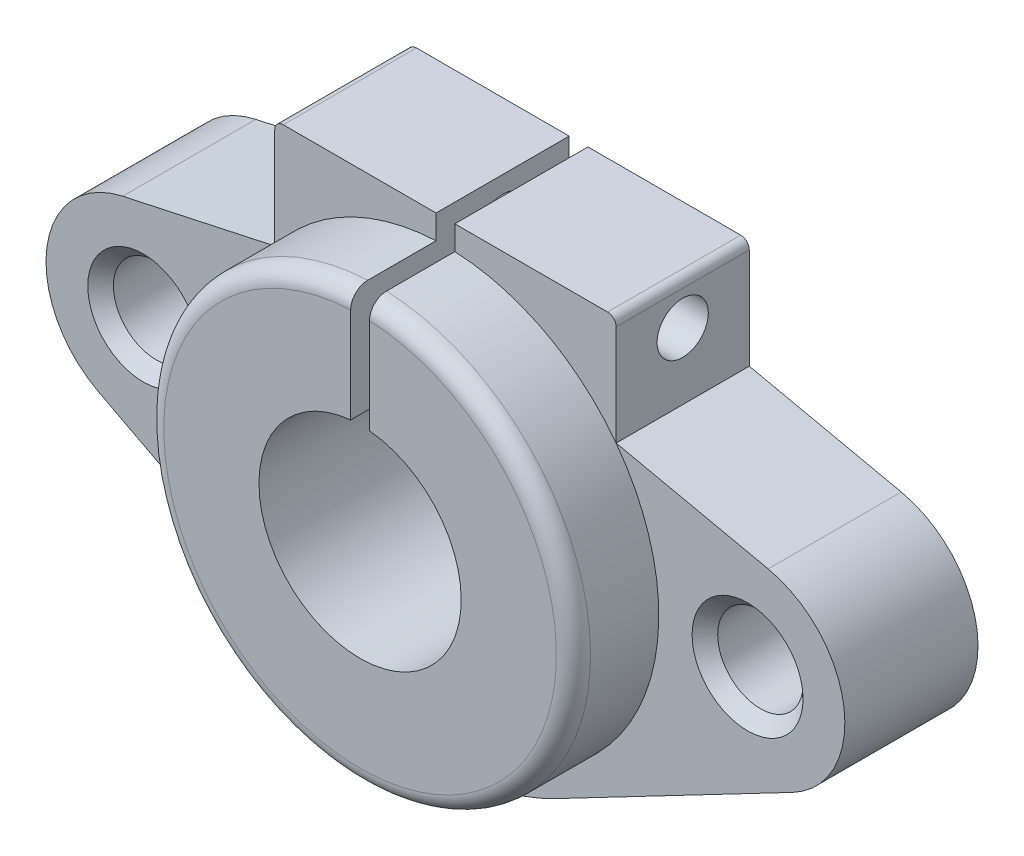
ISO-10303-21;
HEADER;
FILE_DESCRIPTION(('STEP AP214'),'2;1');
FILE_NAME('part.step','',(''),(''),'','','');
FILE_SCHEMA(('AUTOMOTIVE_DESIGN { 1 0 10303 214 1 1 1 1 }'));
ENDSEC;
DATA;
#1=APPLICATION_CONTEXT('core data for automotive mechanical design processes');
#2=APPLICATION_PROTOCOL_DEFINITION('international standard','automotive_design',2000,#1);
#3=PRODUCT_CONTEXT('',#1,'mechanical');
#4=PRODUCT('Part','Part','',(#3));
#5=PRODUCT_RELATED_PRODUCT_CATEGORY('part','',(#4));
#6=PRODUCT_DEFINITION_FORMATION('','',#4);
#7=PRODUCT_DEFINITION_CONTEXT('part definition',#1,'design');
#8=PRODUCT_DEFINITION('design','',#6,#7);
#9=PRODUCT_DEFINITION_SHAPE('','',#8);
#10=(LENGTH_UNIT() NAMED_UNIT(*) SI_UNIT(.MILLI.,.METRE.));
#11=(NAMED_UNIT(*) PLANE_ANGLE_UNIT() SI_UNIT($,.RADIAN.));
#12=(NAMED_UNIT(*) SI_UNIT($,.STERADIAN.) SOLID_ANGLE_UNIT());
#13=UNCERTAINTY_MEASURE_WITH_UNIT(LENGTH_MEASURE(1.E-05),#10,'distance_accuracy_value','');
#14=(GEOMETRIC_REPRESENTATION_CONTEXT(3) GLOBAL_UNCERTAINTY_ASSIGNED_CONTEXT((#13)) GLOBAL_UNIT_ASSIGNED_CONTEXT((#10,
#11,#12)) REPRESENTATION_CONTEXT('',''));
#15=CARTESIAN_POINT('',(0.,0.,0.));
#16=DIRECTION('',(0.,0.,1.));
#17=DIRECTION('',(1.,0.,0.));
#18=AXIS2_PLACEMENT_3D('',#15,#16,#17);
#19=CARTESIAN_POINT('',(0.,0.,12.8));
#20=DIRECTION('',(0.,0.,-1.));
#21=DIRECTION('',(-1.,0.,0.));
#22=AXIS2_PLACEMENT_3D('',#19,#20,#21);
#23=CYLINDRICAL_SURFACE('',#22,12.5);
#24=DIRECTION('',(0.,0.,-1.));
#25=VECTOR('',#24,1.);
#26=CARTESIAN_POINT('',(0.55,12.4878941379241,12.8));
#27=LINE('',#26,#25);
#28=CARTESIAN_POINT('',(0.55,12.4878941379241,7.8));
#29=VERTEX_POINT('',#28);
#30=CARTESIAN_POINT('',(0.55,12.4878941379241,11.8));
#31=VERTEX_POINT('',#30);
#32=EDGE_CURVE('E339',#29,#31,#27,.F.);
#33=ORIENTED_EDGE('',*,*,#32,.T.);
#34=CARTESIAN_POINT('',(0.,0.,11.8));
#35=DIRECTION('',(0.,0.,1.));
#36=DIRECTION('',(1.,0.,0.));
#37=AXIS2_PLACEMENT_3D('',#34,#35,#36);
#38=CIRCLE('',#37,12.5);
#39=CARTESIAN_POINT('',(-0.55,12.4878941379241,11.8));
#40=VERTEX_POINT('',#39);
#41=EDGE_CURVE('E257',#31,#40,#38,.F.);
#42=ORIENTED_EDGE('',*,*,#41,.T.);
#43=DIRECTION('',(0.,0.,-1.));
#44=VECTOR('',#43,1.);
#45=CARTESIAN_POINT('',(-0.55,12.4878941379241,12.8));
#46=LINE('',#45,#44);
#47=CARTESIAN_POINT('',(-0.550000000000001,12.4878941379241,7.8));
#48=VERTEX_POINT('',#47);
#49=EDGE_CURVE('E447',#48,#40,#46,.F.);
#50=ORIENTED_EDGE('',*,*,#49,.F.);
#51=CARTESIAN_POINT('',(0.,0.,7.8));
#52=DIRECTION('',(0.,0.,-1.));
#53=DIRECTION('',(-1.,0.,0.));
#54=AXIS2_PLACEMENT_3D('',#51,#52,#53);
#55=CIRCLE('',#54,12.5);
#56=CARTESIAN_POINT('',(-10.,7.5,7.8));
#57=VERTEX_POINT('',#56);
#58=EDGE_CURVE('E240',#57,#48,#55,.T.);
#59=ORIENTED_EDGE('',*,*,#58,.F.);
#60=CARTESIAN_POINT('',(10.,7.5,7.8));
#61=VERTEX_POINT('',#60);
#62=EDGE_CURVE('E220',#61,#57,#55,.T.);
#63=ORIENTED_EDGE('',*,*,#62,.F.);
#64=EDGE_CURVE('E239',#29,#61,#55,.T.);
#65=ORIENTED_EDGE('',*,*,#64,.F.);
#66=EDGE_LOOP('',(#33,#42,#50,#59,#63,#65));
#67=FACE_BOUND('',#66,.T.);
#68=ADVANCED_FACE('F38',(#67),#23,.T.);
#69=CARTESIAN_POINT('',(0.,0.,12.8));
#70=DIRECTION('',(0.,0.,1.));
#71=DIRECTION('',(1.,0.,0.));
#72=AXIS2_PLACEMENT_3D('',#69,#70,#71);
#73=PLANE('',#72);
#74=DIRECTION('',(0.,1.,0.));
#75=VECTOR('',#74,1.);
#76=CARTESIAN_POINT('',(-0.550000000000005,0.,12.8));
#77=LINE('',#76,#75);
#78=CARTESIAN_POINT('',(-0.550000000000003,5.8994173441112,12.8));
#79=VERTEX_POINT('',#78);
#80=CARTESIAN_POINT('',(-0.550000000000001,11.4868402966177,12.8));
#81=VERTEX_POINT('',#80);
#82=EDGE_CURVE('E449',#79,#81,#77,.T.);
#83=ORIENTED_EDGE('',*,*,#82,.T.);
#84=CARTESIAN_POINT('',(0.,0.,12.8));
#85=DIRECTION('',(0.,0.,1.));
#86=DIRECTION('',(1.,0.,0.));
#87=AXIS2_PLACEMENT_3D('',#84,#85,#86);
#88=CIRCLE('',#87,11.5);
#89=CARTESIAN_POINT('',(0.55,11.4868402966177,12.8));
#90=VERTEX_POINT('',#89);
#91=EDGE_CURVE('E246',#81,#90,#88,.T.);
#92=ORIENTED_EDGE('',*,*,#91,.T.);
#93=DIRECTION('',(0.,1.,0.));
#94=VECTOR('',#93,1.);
#95=CARTESIAN_POINT('',(0.549999999999999,0.,12.8));
#96=LINE('',#95,#94);
#97=CARTESIAN_POINT('',(0.549999999999999,5.8994173441112,12.8));
#98=VERTEX_POINT('',#97);
#99=EDGE_CURVE('E345',#98,#90,#96,.T.);
#100=ORIENTED_EDGE('',*,*,#99,.F.);
#101=CARTESIAN_POINT('',(0.,0.,12.8));
#102=DIRECTION('',(0.,0.,1.));
#103=DIRECTION('',(1.,0.,0.));
#104=AXIS2_PLACEMENT_3D('',#101,#102,#103);
#105=CIRCLE('',#104,5.925);
#106=EDGE_CURVE('E181',#79,#98,#105,.T.);
#107=ORIENTED_EDGE('',*,*,#106,.F.);
#108=EDGE_LOOP('',(#83,#92,#100,#107));
#109=FACE_BOUND('',#108,.T.);
#110=ADVANCED_FACE('F327',(#109),#73,.T.);
#111=CARTESIAN_POINT('',(0.,0.,0.));
#112=DIRECTION('',(0.,0.,1.));
#113=DIRECTION('',(1.,0.,0.));
#114=AXIS2_PLACEMENT_3D('',#111,#112,#113);
#115=PLANE('',#114);
#116=CARTESIAN_POINT('',(17.7,0.,0.));
#117=DIRECTION('',(0.,0.,-1.));
#118=DIRECTION('',(-1.,0.,0.));
#119=AXIS2_PLACEMENT_3D('',#116,#117,#118);
#120=CIRCLE('',#119,2.5);
#121=CARTESIAN_POINT('',(15.2,0.,0.));
#122=VERTEX_POINT('',#121);
#123=EDGE_CURVE('E418',#122,#122,#120,.T.);
#124=ORIENTED_EDGE('',*,*,#123,.F.);
#125=EDGE_LOOP('',(#124));
#126=FACE_BOUND('',#125,.T.);
#127=CARTESIAN_POINT('',(-17.7,0.,0.));
#128=DIRECTION('',(0.,0.,-1.));
#129=DIRECTION('',(-1.,0.,0.));
#130=AXIS2_PLACEMENT_3D('',#127,#128,#129);
#131=CIRCLE('',#130,2.5);
#132=CARTESIAN_POINT('',(-20.2,0.,0.));
#133=VERTEX_POINT('',#132);
#134=EDGE_CURVE('E454',#133,#133,#131,.T.);
#135=ORIENTED_EDGE('',*,*,#134,.F.);
#136=EDGE_LOOP('',(#135));
#137=FACE_BOUND('',#136,.T.);
#138=DIRECTION('',(0.,1.,0.));
#139=VECTOR('',#138,1.);
#140=CARTESIAN_POINT('',(-10.,13.9,0.));
#141=LINE('',#140,#139);
#142=CARTESIAN_POINT('',(-10.,7.5,0.));
#143=VERTEX_POINT('',#142);
#144=CARTESIAN_POINT('',(-10.,13.4,0.));
#145=VERTEX_POINT('',#144);
#146=EDGE_CURVE('E200',#143,#145,#141,.T.);
#147=ORIENTED_EDGE('',*,*,#146,.T.);
#148=CARTESIAN_POINT('',(-9.5,13.4,0.));
#149=DIRECTION('',(0.,0.,1.));
#150=DIRECTION('',(1.,0.,0.));
#151=AXIS2_PLACEMENT_3D('',#148,#149,#150);
#152=CIRCLE('',#151,0.5);
#153=CARTESIAN_POINT('',(-9.5,13.9,0.));
#154=VERTEX_POINT('',#153);
#155=EDGE_CURVE('E367',#145,#154,#152,.F.);
#156=ORIENTED_EDGE('',*,*,#155,.T.);
#157=DIRECTION('',(1.,0.,0.));
#158=VECTOR('',#157,1.);
#159=CARTESIAN_POINT('',(10.,13.9,0.));
#160=LINE('',#159,#158);
#161=CARTESIAN_POINT('',(-0.550000000000004,13.9,0.));
#162=VERTEX_POINT('',#161);
#163=EDGE_CURVE('E199',#154,#162,#160,.T.);
#164=ORIENTED_EDGE('',*,*,#163,.T.);
#165=DIRECTION('',(0.,-1.,0.));
#166=VECTOR('',#165,1.);
#167=CARTESIAN_POINT('',(-0.550000000000005,0.,0.));
#168=LINE('',#167,#166);
#169=CARTESIAN_POINT('',(-0.550000000000003,5.8994173441112,0.));
#170=VERTEX_POINT('',#169);
#171=EDGE_CURVE('E192',#162,#170,#168,.T.);
#172=ORIENTED_EDGE('',*,*,#171,.T.);
#173=CARTESIAN_POINT('',(0.,0.,0.));
#174=DIRECTION('',(0.,0.,1.));
#175=DIRECTION('',(1.,0.,0.));
#176=AXIS2_PLACEMENT_3D('',#173,#174,#175);
#177=CIRCLE('',#176,5.925);
#178=CARTESIAN_POINT('',(0.549999999999999,5.8994173441112,0.));
#179=VERTEX_POINT('',#178);
#180=EDGE_CURVE('E191',#170,#179,#177,.T.);
#181=ORIENTED_EDGE('',*,*,#180,.T.);
#182=DIRECTION('',(0.,-1.,0.));
#183=VECTOR('',#182,1.);
#184=CARTESIAN_POINT('',(0.549999999999999,0.,0.));
#185=LINE('',#184,#183);
#186=CARTESIAN_POINT('',(0.55,13.9,0.));
#187=VERTEX_POINT('',#186);
#188=EDGE_CURVE('E174',#187,#179,#185,.T.);
#189=ORIENTED_EDGE('',*,*,#188,.F.);
#190=CARTESIAN_POINT('',(9.5,13.9,0.));
#191=VERTEX_POINT('',#190);
#192=EDGE_CURVE('E188',#187,#191,#160,.T.);
#193=ORIENTED_EDGE('',*,*,#192,.T.);
#194=CARTESIAN_POINT('',(9.5,13.4,0.));
#195=DIRECTION('',(0.,0.,1.));
#196=DIRECTION('',(1.,0.,0.));
#197=AXIS2_PLACEMENT_3D('',#194,#195,#196);
#198=CIRCLE('',#197,0.5);
#199=CARTESIAN_POINT('',(10.,13.4,0.));
#200=VERTEX_POINT('',#199);
#201=EDGE_CURVE('E355',#191,#200,#198,.F.);
#202=ORIENTED_EDGE('',*,*,#201,.T.);
#203=DIRECTION('',(0.,-1.,0.));
#204=VECTOR('',#203,1.);
#205=CARTESIAN_POINT('',(10.,13.9,0.));
#206=LINE('',#205,#204);
#207=CARTESIAN_POINT('',(10.,7.5,0.));
#208=VERTEX_POINT('',#207);
#209=EDGE_CURVE('E202',#200,#208,#206,.T.);
#210=ORIENTED_EDGE('',*,*,#209,.T.);
#211=DIRECTION('',(0.97733655009733,-0.211691444899997,0.));
#212=VECTOR('',#211,1.);
#213=CARTESIAN_POINT('',(10.,7.5,0.));
#214=LINE('',#213,#212);
#215=CARTESIAN_POINT('',(18.90664123593,5.57081833555478,0.));
#216=VERTEX_POINT('',#215);
#217=EDGE_CURVE('E208',#208,#216,#214,.T.);
#218=ORIENTED_EDGE('',*,*,#217,.T.);
#219=CARTESIAN_POINT('',(17.7,0.,0.));
#220=DIRECTION('',(0.,0.,-1.));
#221=DIRECTION('',(1.,0.,0.));
#222=AXIS2_PLACEMENT_3D('',#219,#220,#221);
#223=CIRCLE('',#222,5.7);
#224=CARTESIAN_POINT('',(20.3406779661017,-5.05141761086381,0.));
#225=VERTEX_POINT('',#224);
#226=EDGE_CURVE('E211',#216,#225,#223,.T.);
#227=ORIENTED_EDGE('',*,*,#226,.T.);
#228=DIRECTION('',(-0.886213615941019,-0.463276836158192,0.));
#229=VECTOR('',#228,1.);
#230=CARTESIAN_POINT('',(6.43954802259887,-12.3183692615802,0.));
#231=LINE('',#230,#229);
#232=CARTESIAN_POINT('',(6.43954802259887,-12.3183692615802,0.));
#233=VERTEX_POINT('',#232);
#234=EDGE_CURVE('E214',#225,#233,#231,.T.);
#235=ORIENTED_EDGE('',*,*,#234,.T.);
#236=CARTESIAN_POINT('',(0.,0.,0.));
#237=DIRECTION('',(0.,0.,-1.));
#238=DIRECTION('',(-1.,0.,0.));
#239=AXIS2_PLACEMENT_3D('',#236,#237,#238);
#240=CIRCLE('',#239,13.9);
#241=CARTESIAN_POINT('',(-6.43954802259888,-12.3183692615802,0.));
#242=VERTEX_POINT('',#241);
#243=EDGE_CURVE('E414',#233,#242,#240,.T.);
#244=ORIENTED_EDGE('',*,*,#243,.T.);
#245=DIRECTION('',(-0.886213615941019,0.463276836158192,0.));
#246=VECTOR('',#245,1.);
#247=CARTESIAN_POINT('',(-6.43954802259888,-12.3183692615802,0.));
#248=LINE('',#247,#246);
#249=CARTESIAN_POINT('',(-20.3406779661017,-5.0514176108638,0.));
#250=VERTEX_POINT('',#249);
#251=EDGE_CURVE('E417',#242,#250,#248,.T.);
#252=ORIENTED_EDGE('',*,*,#251,.T.);
#253=CARTESIAN_POINT('',(-17.7,0.,0.));
#254=DIRECTION('',(0.,0.,-1.));
#255=DIRECTION('',(1.,0.,0.));
#256=AXIS2_PLACEMENT_3D('',#253,#254,#255);
#257=CIRCLE('',#256,5.7);
#258=CARTESIAN_POINT('',(-18.90664123593,5.57081833555479,0.));
#259=VERTEX_POINT('',#258);
#260=EDGE_CURVE('E421',#250,#259,#257,.T.);
#261=ORIENTED_EDGE('',*,*,#260,.T.);
#262=DIRECTION('',(0.97733655009733,0.211691444899997,0.));
#263=VECTOR('',#262,1.);
#264=CARTESIAN_POINT('',(-10.,7.5,0.));
#265=LINE('',#264,#263);
#266=EDGE_CURVE('E203',#259,#143,#265,.T.);
#267=ORIENTED_EDGE('',*,*,#266,.T.);
#268=EDGE_LOOP('',(#147,#156,#164,#172,#181,#189,#193,#202,#210,#218,#227,#235,#244,#252,#261,#267));
#269=FACE_BOUND('',#268,.T.);
#270=ADVANCED_FACE('F187',(#126,#137,#269),#115,.F.);
#271=CARTESIAN_POINT('',(0.,0.,12.8));
#272=DIRECTION('',(0.,0.,-1.));
#273=DIRECTION('',(-1.,0.,0.));
#274=AXIS2_PLACEMENT_3D('',#271,#272,#273);
#275=CYLINDRICAL_SURFACE('',#274,5.925);
#276=ORIENTED_EDGE('',*,*,#180,.F.);
#277=DIRECTION('',(0.,0.,-1.));
#278=VECTOR('',#277,1.);
#279=CARTESIAN_POINT('',(-0.550000000000003,5.8994173441112,13.));
#280=LINE('',#279,#278);
#281=EDGE_CURVE('E478',#79,#170,#280,.T.);
#282=ORIENTED_EDGE('',*,*,#281,.F.);
#283=ORIENTED_EDGE('',*,*,#106,.T.);
#284=DIRECTION('',(0.,0.,-1.));
#285=VECTOR('',#284,1.);
#286=CARTESIAN_POINT('',(0.549999999999999,5.8994173441112,13.));
#287=LINE('',#286,#285);
#288=EDGE_CURVE('E480',#98,#179,#287,.T.);
#289=ORIENTED_EDGE('',*,*,#288,.T.);
#290=EDGE_LOOP('',(#276,#282,#283,#289));
#291=FACE_BOUND('',#290,.T.);
#292=ADVANCED_FACE('F323',(#291),#275,.F.);
#293=CARTESIAN_POINT('',(0.,0.,7.8));
#294=DIRECTION('',(0.,0.,-1.));
#295=DIRECTION('',(-1.,0.,0.));
#296=AXIS2_PLACEMENT_3D('',#293,#294,#295);
#297=PLANE('',#296);
#298=DIRECTION('',(1.,0.,0.));
#299=VECTOR('',#298,1.);
#300=CARTESIAN_POINT('',(10.,13.9,7.8));
#301=LINE('',#300,#299);
#302=CARTESIAN_POINT('',(-9.5,13.9,7.8));
#303=VERTEX_POINT('',#302);
#304=CARTESIAN_POINT('',(-0.55,13.9,7.8));
#305=VERTEX_POINT('',#304);
#306=EDGE_CURVE('E408',#303,#305,#301,.T.);
#307=ORIENTED_EDGE('',*,*,#306,.F.);
#308=CARTESIAN_POINT('',(-9.5,13.4,7.8));
#309=DIRECTION('',(0.,0.,-1.));
#310=DIRECTION('',(-1.,0.,0.));
#311=AXIS2_PLACEMENT_3D('',#308,#309,#310);
#312=CIRCLE('',#311,0.5);
#313=CARTESIAN_POINT('',(-10.,13.4,7.8));
#314=VERTEX_POINT('',#313);
#315=EDGE_CURVE('E371',#303,#314,#312,.F.);
#316=ORIENTED_EDGE('',*,*,#315,.T.);
#317=DIRECTION('',(0.,1.,0.));
#318=VECTOR('',#317,1.);
#319=CARTESIAN_POINT('',(-10.,13.9,7.8));
#320=LINE('',#319,#318);
#321=EDGE_CURVE('E433',#57,#314,#320,.T.);
#322=ORIENTED_EDGE('',*,*,#321,.F.);
#323=ORIENTED_EDGE('',*,*,#58,.T.);
#324=DIRECTION('',(0.,-1.,0.));
#325=VECTOR('',#324,1.);
#326=CARTESIAN_POINT('',(-0.550000000000005,0.,7.8));
#327=LINE('',#326,#325);
#328=EDGE_CURVE('E444',#305,#48,#327,.T.);
#329=ORIENTED_EDGE('',*,*,#328,.F.);
#330=EDGE_LOOP('',(#307,#316,#322,#323,#329));
#331=FACE_BOUND('',#330,.T.);
#332=ADVANCED_FACE('F285',(#331),#297,.F.);
#333=CARTESIAN_POINT('',(10.,13.9,7.8));
#334=DIRECTION('',(0.,1.,0.));
#335=DIRECTION('',(-1.,0.,0.));
#336=AXIS2_PLACEMENT_3D('',#333,#334,#335);
#337=PLANE('',#336);
#338=ORIENTED_EDGE('',*,*,#163,.F.);
#339=DIRECTION('',(0.,0.,-1.));
#340=VECTOR('',#339,1.);
#341=CARTESIAN_POINT('',(-9.5,13.9,7.8));
#342=LINE('',#341,#340);
#343=EDGE_CURVE('E369',#154,#303,#342,.F.);
#344=ORIENTED_EDGE('',*,*,#343,.T.);
#345=ORIENTED_EDGE('',*,*,#306,.T.);
#346=DIRECTION('',(0.,0.,-1.));
#347=VECTOR('',#346,1.);
#348=CARTESIAN_POINT('',(-0.55,13.9,7.8));
#349=LINE('',#348,#347);
#350=EDGE_CURVE('E180',#305,#162,#349,.T.);
#351=ORIENTED_EDGE('',*,*,#350,.T.);
#352=EDGE_LOOP('',(#338,#344,#345,#351));
#353=FACE_BOUND('',#352,.T.);
#354=ADVANCED_FACE('F284',(#353),#337,.T.);
#355=DIRECTION('',(0.,-1.,0.));
#356=VECTOR('',#355,1.);
#357=CARTESIAN_POINT('',(10.,13.9,7.8));
#358=LINE('',#357,#356);
#359=CARTESIAN_POINT('',(10.,13.4,7.8));
#360=VERTEX_POINT('',#359);
#361=EDGE_CURVE('E405',#360,#61,#358,.T.);
#362=ORIENTED_EDGE('',*,*,#361,.F.);
#363=CARTESIAN_POINT('',(9.5,13.4,7.8));
#364=DIRECTION('',(0.,0.,-1.));
#365=DIRECTION('',(-1.,0.,0.));
#366=AXIS2_PLACEMENT_3D('',#363,#364,#365);
#367=CIRCLE('',#366,0.5);
#368=CARTESIAN_POINT('',(9.5,13.9,7.8));
#369=VERTEX_POINT('',#368);
#370=EDGE_CURVE('E60',#360,#369,#367,.F.);
#371=ORIENTED_EDGE('',*,*,#370,.T.);
#372=CARTESIAN_POINT('',(0.55,13.9,7.8));
#373=VERTEX_POINT('',#372);
#374=EDGE_CURVE('E468',#373,#369,#301,.T.);
#375=ORIENTED_EDGE('',*,*,#374,.F.);
#376=DIRECTION('',(0.,-1.,0.));
#377=VECTOR('',#376,1.);
#378=CARTESIAN_POINT('',(0.549999999999999,0.,7.8));
#379=LINE('',#378,#377);
#380=EDGE_CURVE('E177',#373,#29,#379,.T.);
#381=ORIENTED_EDGE('',*,*,#380,.T.);
#382=ORIENTED_EDGE('',*,*,#64,.T.);
#383=EDGE_LOOP('',(#362,#371,#375,#381,#382));
#384=FACE_BOUND('',#383,.T.);
#385=ADVANCED_FACE('F280',(#384),#297,.F.);
#386=CARTESIAN_POINT('',(-17.7,0.,7.8));
#387=DIRECTION('',(0.,0.,-1.));
#388=DIRECTION('',(-1.,0.,0.));
#389=AXIS2_PLACEMENT_3D('',#386,#387,#388);
#390=CIRCLE('',#389,3.25);
#391=CARTESIAN_POINT('',(-20.95,0.,7.8));
#392=VERTEX_POINT('',#391);
#393=EDGE_CURVE('E379',#392,#392,#390,.T.);
#394=ORIENTED_EDGE('',*,*,#393,.T.);
#395=EDGE_LOOP('',(#394));
#396=FACE_BOUND('',#395,.T.);
#397=CARTESIAN_POINT('',(17.7,0.,7.8));
#398=DIRECTION('',(0.,0.,-1.));
#399=DIRECTION('',(-1.,0.,0.));
#400=AXIS2_PLACEMENT_3D('',#397,#398,#399);
#401=CIRCLE('',#400,3.25);
#402=CARTESIAN_POINT('',(14.45,0.,7.8));
#403=VERTEX_POINT('',#402);
#404=EDGE_CURVE('E376',#403,#403,#401,.T.);
#405=ORIENTED_EDGE('',*,*,#404,.T.);
#406=EDGE_LOOP('',(#405));
#407=FACE_BOUND('',#406,.T.);
#408=DIRECTION('',(0.97733655009733,-0.211691444899997,0.));
#409=VECTOR('',#408,1.);
#410=CARTESIAN_POINT('',(10.,7.5,7.8));
#411=LINE('',#410,#409);
#412=CARTESIAN_POINT('',(18.90664123593,5.57081833555478,7.8));
#413=VERTEX_POINT('',#412);
#414=EDGE_CURVE('E398',#61,#413,#411,.T.);
#415=ORIENTED_EDGE('',*,*,#414,.F.);
#416=ORIENTED_EDGE('',*,*,#62,.T.);
#417=DIRECTION('',(0.97733655009733,0.211691444899997,0.));
#418=VECTOR('',#417,1.);
#419=CARTESIAN_POINT('',(-10.,7.5,7.8));
#420=LINE('',#419,#418);
#421=CARTESIAN_POINT('',(-18.90664123593,5.57081833555479,7.8));
#422=VERTEX_POINT('',#421);
#423=EDGE_CURVE('E428',#422,#57,#420,.T.);
#424=ORIENTED_EDGE('',*,*,#423,.F.);
#425=CARTESIAN_POINT('',(-17.7,0.,7.8));
#426=DIRECTION('',(0.,0.,-1.));
#427=DIRECTION('',(1.,0.,0.));
#428=AXIS2_PLACEMENT_3D('',#425,#426,#427);
#429=CIRCLE('',#428,5.7);
#430=CARTESIAN_POINT('',(-20.3406779661017,-5.0514176108638,7.8));
#431=VERTEX_POINT('',#430);
#432=EDGE_CURVE('E464',#431,#422,#429,.T.);
#433=ORIENTED_EDGE('',*,*,#432,.F.);
#434=DIRECTION('',(-0.886213615941019,0.463276836158192,0.));
#435=VECTOR('',#434,1.);
#436=CARTESIAN_POINT('',(-6.43954802259888,-12.3183692615802,7.8));
#437=LINE('',#436,#435);
#438=CARTESIAN_POINT('',(-6.43954802259888,-12.3183692615802,7.8));
#439=VERTEX_POINT('',#438);
#440=EDGE_CURVE('E461',#439,#431,#437,.T.);
#441=ORIENTED_EDGE('',*,*,#440,.F.);
#442=CARTESIAN_POINT('',(0.,0.,7.8));
#443=DIRECTION('',(0.,0.,-1.));
#444=DIRECTION('',(-1.,0.,0.));
#445=AXIS2_PLACEMENT_3D('',#442,#443,#444);
#446=CIRCLE('',#445,13.9);
#447=CARTESIAN_POINT('',(6.43954802259887,-12.3183692615802,7.8));
#448=VERTEX_POINT('',#447);
#449=EDGE_CURVE('E217',#448,#439,#446,.T.);
#450=ORIENTED_EDGE('',*,*,#449,.F.);
#451=DIRECTION('',(-0.886213615941019,-0.463276836158192,0.));
#452=VECTOR('',#451,1.);
#453=CARTESIAN_POINT('',(6.43954802259887,-12.3183692615802,7.8));
#454=LINE('',#453,#452);
#455=CARTESIAN_POINT('',(20.3406779661017,-5.05141761086381,7.8));
#456=VERTEX_POINT('',#455);
#457=EDGE_CURVE('E236',#456,#448,#454,.T.);
#458=ORIENTED_EDGE('',*,*,#457,.F.);
#459=CARTESIAN_POINT('',(17.7,0.,7.8));
#460=DIRECTION('',(0.,0.,-1.));
#461=DIRECTION('',(1.,0.,0.));
#462=AXIS2_PLACEMENT_3D('',#459,#460,#461);
#463=CIRCLE('',#462,5.7);
#464=EDGE_CURVE('E403',#413,#456,#463,.T.);
#465=ORIENTED_EDGE('',*,*,#464,.F.);
#466=EDGE_LOOP('',(#415,#416,#424,#433,#441,#450,#458,#465));
#467=FACE_BOUND('',#466,.T.);
#468=ADVANCED_FACE('F283',(#396,#407,#467),#297,.F.);
#469=CARTESIAN_POINT('',(0.,0.,7.8));
#470=DIRECTION('',(0.,0.,-1.));
#471=DIRECTION('',(-1.,0.,0.));
#472=AXIS2_PLACEMENT_3D('',#469,#470,#471);
#473=CYLINDRICAL_SURFACE('',#472,13.9);
#474=ORIENTED_EDGE('',*,*,#243,.F.);
#475=DIRECTION('',(0.,0.,-1.));
#476=VECTOR('',#475,1.);
#477=CARTESIAN_POINT('',(6.43954802259887,-12.3183692615802,7.8));
#478=LINE('',#477,#476);
#479=EDGE_CURVE('E218',#448,#233,#478,.T.);
#480=ORIENTED_EDGE('',*,*,#479,.F.);
#481=ORIENTED_EDGE('',*,*,#449,.T.);
#482=DIRECTION('',(0.,0.,-1.));
#483=VECTOR('',#482,1.);
#484=CARTESIAN_POINT('',(-6.43954802259888,-12.3183692615802,7.8));
#485=LINE('',#484,#483);
#486=EDGE_CURVE('E234',#439,#242,#485,.T.);
#487=ORIENTED_EDGE('',*,*,#486,.T.);
#488=EDGE_LOOP('',(#474,#480,#481,#487));
#489=FACE_BOUND('',#488,.T.);
#490=ADVANCED_FACE('F290',(#489),#473,.T.);
#491=CARTESIAN_POINT('',(6.43954802259887,-12.3183692615802,7.8));
#492=DIRECTION('',(0.463276836158192,-0.886213615941019,0.));
#493=DIRECTION('',(0.886213615941019,0.463276836158192,0.));
#494=AXIS2_PLACEMENT_3D('',#491,#492,#493);
#495=PLANE('',#494);
#496=ORIENTED_EDGE('',*,*,#234,.F.);
#497=DIRECTION('',(0.,0.,-1.));
#498=VECTOR('',#497,1.);
#499=CARTESIAN_POINT('',(20.3406779661017,-5.05141761086381,7.8));
#500=LINE('',#499,#498);
#501=EDGE_CURVE('E221',#456,#225,#500,.T.);
#502=ORIENTED_EDGE('',*,*,#501,.F.);
#503=ORIENTED_EDGE('',*,*,#457,.T.);
#504=ORIENTED_EDGE('',*,*,#479,.T.);
#505=EDGE_LOOP('',(#496,#502,#503,#504));
#506=FACE_BOUND('',#505,.T.);
#507=ADVANCED_FACE('F286',(#506),#495,.T.);
#508=CARTESIAN_POINT('',(17.7,0.,7.8));
#509=DIRECTION('',(0.,0.,-1.));
#510=DIRECTION('',(-1.,0.,0.));
#511=AXIS2_PLACEMENT_3D('',#508,#509,#510);
#512=CYLINDRICAL_SURFACE('',#511,5.7);
#513=ORIENTED_EDGE('',*,*,#226,.F.);
#514=DIRECTION('',(0.,0.,-1.));
#515=VECTOR('',#514,1.);
#516=CARTESIAN_POINT('',(18.90664123593,5.57081833555478,7.8));
#517=LINE('',#516,#515);
#518=EDGE_CURVE('E223',#413,#216,#517,.T.);
#519=ORIENTED_EDGE('',*,*,#518,.F.);
#520=ORIENTED_EDGE('',*,*,#464,.T.);
#521=ORIENTED_EDGE('',*,*,#501,.T.);
#522=EDGE_LOOP('',(#513,#519,#520,#521));
#523=FACE_BOUND('',#522,.T.);
#524=ADVANCED_FACE('F289',(#523),#512,.T.);
#525=CARTESIAN_POINT('',(10.,7.5,7.8));
#526=DIRECTION('',(0.211691444899997,0.97733655009733,0.));
#527=DIRECTION('',(-0.97733655009733,0.211691444899998,0.));
#528=AXIS2_PLACEMENT_3D('',#525,#526,#527);
#529=PLANE('',#528);
#530=ORIENTED_EDGE('',*,*,#217,.F.);
#531=DIRECTION('',(0.,0.,-1.));
#532=VECTOR('',#531,1.);
#533=CARTESIAN_POINT('',(10.,7.5,7.8));
#534=LINE('',#533,#532);
#535=EDGE_CURVE('E225',#61,#208,#534,.T.);
#536=ORIENTED_EDGE('',*,*,#535,.F.);
#537=ORIENTED_EDGE('',*,*,#414,.T.);
#538=ORIENTED_EDGE('',*,*,#518,.T.);
#539=EDGE_LOOP('',(#530,#536,#537,#538));
#540=FACE_BOUND('',#539,.T.);
#541=ADVANCED_FACE('F294',(#540),#529,.T.);
#542=CARTESIAN_POINT('',(10.,13.9,7.8));
#543=DIRECTION('',(1.,0.,0.));
#544=DIRECTION('',(0.,0.,-1.));
#545=AXIS2_PLACEMENT_3D('',#542,#543,#544);
#546=PLANE('',#545);
#547=CARTESIAN_POINT('',(10.,11.4,3.9));
#548=DIRECTION('',(1.,0.,0.));
#549=DIRECTION('',(0.,0.,-1.));
#550=AXIS2_PLACEMENT_3D('',#547,#548,#549);
#551=CIRCLE('',#550,1.5);
#552=CARTESIAN_POINT('',(10.,11.4,2.4));
#553=VERTEX_POINT('',#552);
#554=EDGE_CURVE('E487',#553,#553,#551,.T.);
#555=ORIENTED_EDGE('',*,*,#554,.F.);
#556=EDGE_LOOP('',(#555));
#557=FACE_BOUND('',#556,.T.);
#558=ORIENTED_EDGE('',*,*,#209,.F.);
#559=DIRECTION('',(0.,0.,-1.));
#560=VECTOR('',#559,1.);
#561=CARTESIAN_POINT('',(10.,13.4,7.8));
#562=LINE('',#561,#560);
#563=EDGE_CURVE('E53',#200,#360,#562,.F.);
#564=ORIENTED_EDGE('',*,*,#563,.T.);
#565=ORIENTED_EDGE('',*,*,#361,.T.);
#566=ORIENTED_EDGE('',*,*,#535,.T.);
#567=EDGE_LOOP('',(#558,#564,#565,#566));
#568=FACE_BOUND('',#567,.T.);
#569=ADVANCED_FACE('F298',(#557,#568),#546,.T.);
#570=ORIENTED_EDGE('',*,*,#374,.T.);
#571=DIRECTION('',(0.,0.,-1.));
#572=VECTOR('',#571,1.);
#573=CARTESIAN_POINT('',(9.5,13.9,7.8));
#574=LINE('',#573,#572);
#575=EDGE_CURVE('E198',#369,#191,#574,.T.);
#576=ORIENTED_EDGE('',*,*,#575,.T.);
#577=ORIENTED_EDGE('',*,*,#192,.F.);
#578=DIRECTION('',(0.,0.,-1.));
#579=VECTOR('',#578,1.);
#580=CARTESIAN_POINT('',(0.55,13.9,7.8));
#581=LINE('',#580,#579);
#582=EDGE_CURVE('E170',#373,#187,#581,.T.);
#583=ORIENTED_EDGE('',*,*,#582,.F.);
#584=EDGE_LOOP('',(#570,#576,#577,#583));
#585=FACE_BOUND('',#584,.T.);
#586=ADVANCED_FACE('F196',(#585),#337,.T.);
#587=CARTESIAN_POINT('',(-10.,13.9,7.8));
#588=DIRECTION('',(-1.,0.,0.));
#589=DIRECTION('',(0.,0.,1.));
#590=AXIS2_PLACEMENT_3D('',#587,#588,#589);
#591=PLANE('',#590);
#592=CARTESIAN_POINT('',(-10.,11.4,3.9));
#593=DIRECTION('',(1.,0.,0.));
#594=DIRECTION('',(0.,0.,-1.));
#595=AXIS2_PLACEMENT_3D('',#592,#593,#594);
#596=CIRCLE('',#595,1.5);
#597=CARTESIAN_POINT('',(-10.,11.4,2.4));
#598=VERTEX_POINT('',#597);
#599=EDGE_CURVE('E364',#598,#598,#596,.T.);
#600=ORIENTED_EDGE('',*,*,#599,.T.);
#601=EDGE_LOOP('',(#600));
#602=FACE_BOUND('',#601,.T.);
#603=ORIENTED_EDGE('',*,*,#321,.T.);
#604=DIRECTION('',(0.,0.,-1.));
#605=VECTOR('',#604,1.);
#606=CARTESIAN_POINT('',(-10.,13.4,7.8));
#607=LINE('',#606,#605);
#608=EDGE_CURVE('E351',#314,#145,#607,.T.);
#609=ORIENTED_EDGE('',*,*,#608,.T.);
#610=ORIENTED_EDGE('',*,*,#146,.F.);
#611=DIRECTION('',(0.,0.,-1.));
#612=VECTOR('',#611,1.);
#613=CARTESIAN_POINT('',(-10.,7.5,7.8));
#614=LINE('',#613,#612);
#615=EDGE_CURVE('E228',#57,#143,#614,.T.);
#616=ORIENTED_EDGE('',*,*,#615,.F.);
#617=EDGE_LOOP('',(#603,#609,#610,#616));
#618=FACE_BOUND('',#617,.T.);
#619=ADVANCED_FACE('F305',(#602,#618),#591,.T.);
#620=CARTESIAN_POINT('',(-10.,7.5,7.8));
#621=DIRECTION('',(-0.211691444899997,0.97733655009733,0.));
#622=DIRECTION('',(-0.977336550097331,-0.211691444899997,0.));
#623=AXIS2_PLACEMENT_3D('',#620,#621,#622);
#624=PLANE('',#623);
#625=ORIENTED_EDGE('',*,*,#266,.F.);
#626=DIRECTION('',(0.,0.,-1.));
#627=VECTOR('',#626,1.);
#628=CARTESIAN_POINT('',(-18.90664123593,5.57081833555479,7.8));
#629=LINE('',#628,#627);
#630=EDGE_CURVE('E230',#422,#259,#629,.T.);
#631=ORIENTED_EDGE('',*,*,#630,.F.);
#632=ORIENTED_EDGE('',*,*,#423,.T.);
#633=ORIENTED_EDGE('',*,*,#615,.T.);
#634=EDGE_LOOP('',(#625,#631,#632,#633));
#635=FACE_BOUND('',#634,.T.);
#636=ADVANCED_FACE('F308',(#635),#624,.T.);
#637=CARTESIAN_POINT('',(-17.7,0.,7.8));
#638=DIRECTION('',(0.,0.,-1.));
#639=DIRECTION('',(-1.,0.,0.));
#640=AXIS2_PLACEMENT_3D('',#637,#638,#639);
#641=CYLINDRICAL_SURFACE('',#640,5.7);
#642=ORIENTED_EDGE('',*,*,#260,.F.);
#643=DIRECTION('',(0.,0.,-1.));
#644=VECTOR('',#643,1.);
#645=CARTESIAN_POINT('',(-20.3406779661017,-5.0514176108638,7.8));
#646=LINE('',#645,#644);
#647=EDGE_CURVE('E232',#431,#250,#646,.T.);
#648=ORIENTED_EDGE('',*,*,#647,.F.);
#649=ORIENTED_EDGE('',*,*,#432,.T.);
#650=ORIENTED_EDGE('',*,*,#630,.T.);
#651=EDGE_LOOP('',(#642,#648,#649,#650));
#652=FACE_BOUND('',#651,.T.);
#653=ADVANCED_FACE('F312',(#652),#641,.T.);
#654=CARTESIAN_POINT('',(-6.43954802259888,-12.3183692615802,7.8));
#655=DIRECTION('',(-0.463276836158192,-0.886213615941019,0.));
#656=DIRECTION('',(0.886213615941019,-0.463276836158192,0.));
#657=AXIS2_PLACEMENT_3D('',#654,#655,#656);
#658=PLANE('',#657);
#659=ORIENTED_EDGE('',*,*,#251,.F.);
#660=ORIENTED_EDGE('',*,*,#486,.F.);
#661=ORIENTED_EDGE('',*,*,#440,.T.);
#662=ORIENTED_EDGE('',*,*,#647,.T.);
#663=EDGE_LOOP('',(#659,#660,#661,#662));
#664=FACE_BOUND('',#663,.T.);
#665=ADVANCED_FACE('F278',(#664),#658,.T.);
#666=CARTESIAN_POINT('',(17.7,0.,7.8));
#667=DIRECTION('',(0.,0.,-1.));
#668=DIRECTION('',(-1.,0.,0.));
#669=AXIS2_PLACEMENT_3D('',#666,#667,#668);
#670=CYLINDRICAL_SURFACE('',#669,2.5);
#671=CARTESIAN_POINT('',(17.7,0.,7.04999999999999));
#672=DIRECTION('',(0.,0.,-1.));
#673=DIRECTION('',(-1.,0.,0.));
#674=AXIS2_PLACEMENT_3D('',#671,#672,#673);
#675=CIRCLE('',#674,2.5);
#676=CARTESIAN_POINT('',(15.2,0.,7.04999999999999));
#677=VERTEX_POINT('',#676);
#678=EDGE_CURVE('E11',#677,#677,#675,.F.);
#679=ORIENTED_EDGE('',*,*,#678,.T.);
#680=EDGE_LOOP('',(#679));
#681=FACE_BOUND('',#680,.T.);
#682=ORIENTED_EDGE('',*,*,#123,.T.);
#683=EDGE_LOOP('',(#682));
#684=FACE_BOUND('',#683,.T.);
#685=ADVANCED_FACE('F274',(#681,#684),#670,.F.);
#686=CARTESIAN_POINT('',(-17.7,0.,7.8));
#687=DIRECTION('',(0.,0.,-1.));
#688=DIRECTION('',(-1.,0.,0.));
#689=AXIS2_PLACEMENT_3D('',#686,#687,#688);
#690=CYLINDRICAL_SURFACE('',#689,2.5);
#691=CARTESIAN_POINT('',(-17.7,0.,7.04999999999999));
#692=DIRECTION('',(0.,0.,-1.));
#693=DIRECTION('',(-1.,0.,0.));
#694=AXIS2_PLACEMENT_3D('',#691,#692,#693);
#695=CIRCLE('',#694,2.5);
#696=CARTESIAN_POINT('',(-20.2,0.,7.04999999999999));
#697=VERTEX_POINT('',#696);
#698=EDGE_CURVE('E46',#697,#697,#695,.F.);
#699=ORIENTED_EDGE('',*,*,#698,.T.);
#700=EDGE_LOOP('',(#699));
#701=FACE_BOUND('',#700,.T.);
#702=ORIENTED_EDGE('',*,*,#134,.T.);
#703=EDGE_LOOP('',(#702));
#704=FACE_BOUND('',#703,.T.);
#705=ADVANCED_FACE('F268',(#701,#704),#690,.F.);
#706=CARTESIAN_POINT('',(0.549999999999999,0.,13.));
#707=DIRECTION('',(1.,0.,0.));
#708=DIRECTION('',(0.,1.,0.));
#709=AXIS2_PLACEMENT_3D('',#706,#707,#708);
#710=PLANE('',#709);
#711=CARTESIAN_POINT('',(0.55,11.4,3.9));
#712=DIRECTION('',(1.,0.,0.));
#713=DIRECTION('',(0.,1.,0.));
#714=AXIS2_PLACEMENT_3D('',#711,#712,#713);
#715=CIRCLE('',#714,1.5);
#716=CARTESIAN_POINT('',(0.55,12.9,3.9));
#717=VERTEX_POINT('',#716);
#718=EDGE_CURVE('E193',#717,#717,#715,.T.);
#719=ORIENTED_EDGE('',*,*,#718,.T.);
#720=EDGE_LOOP('',(#719));
#721=FACE_BOUND('',#720,.T.);
#722=ORIENTED_EDGE('',*,*,#99,.T.);
#723=CARTESIAN_POINT('',(0.55,11.4868402966177,12.8));
#724=CARTESIAN_POINT('',(0.55,11.5150273322983,12.7999997959397));
#725=CARTESIAN_POINT('',(0.55,11.5432008813989,12.7988102172972));
#726=CARTESIAN_POINT('',(0.55,11.5993466074568,12.7940642700517));
#727=CARTESIAN_POINT('',(0.55,11.6273187934027,12.7905080077655));
#728=CARTESIAN_POINT('',(0.55,11.7105858035144,12.776322259398));
#729=CARTESIAN_POINT('',(0.55,11.7653232247429,12.7621757219753));
#730=CARTESIAN_POINT('',(0.55,11.8716450769783,12.7248927873259));
#731=CARTESIAN_POINT('',(0.55,11.9232279329868,12.7017519411892));
#732=CARTESIAN_POINT('',(0.55,12.0217714825569,12.6471363934388));
#733=CARTESIAN_POINT('',(0.55,12.0687330379221,12.6156632497298));
#734=CARTESIAN_POINT('',(0.55,12.156671491426,12.5452935830153));
#735=CARTESIAN_POINT('',(0.55,12.1976518459186,12.506401377479));
#736=CARTESIAN_POINT('',(0.55,12.2725022769895,12.4222734184994));
#737=CARTESIAN_POINT('',(0.55,12.30637097209,12.3770364353906));
#738=CARTESIAN_POINT('',(0.55,12.3659943927298,12.2815554362103));
#739=CARTESIAN_POINT('',(0.55,12.3917556650716,12.2313155034406));
#740=CARTESIAN_POINT('',(0.55,12.4344561810849,12.1272313069593));
#741=CARTESIAN_POINT('',(0.55,12.4514007167903,12.0733892273054));
#742=CARTESIAN_POINT('',(0.55,12.4717396684384,11.9826767760876));
#743=CARTESIAN_POINT('',(0.55,12.4777939487517,11.9463805633656));
#744=CARTESIAN_POINT('',(0.55,12.4858706153515,11.8733946782345));
#745=CARTESIAN_POINT('',(0.55,12.4878987240574,11.8367056388809));
#746=CARTESIAN_POINT('',(0.55,12.4878941379241,11.8));
#747=B_SPLINE_CURVE_WITH_KNOTS('',3,(#723,#724,#725,#726,#727,#728,#729,#730,#731,#732,#733,
#734,#735,#736,#737,#738,#739,#740,#741,#742,#743,#744,#745,#746),.UNSPECIFIED.,.F.,.F.,(4,2,2,
2,2,2,2,2,2,2,2,4),(0.,0.0845092136742887,0.169014631259785,0.337752548338539,0.50657403572464,
0.675363980517337,0.844055997237434,1.01278075302699,1.18136891067806,1.34985576027757,
1.4600410822713,1.57006968483039),.UNSPECIFIED.);
#748=EDGE_CURVE('E249',#90,#31,#747,.T.);
#749=ORIENTED_EDGE('',*,*,#748,.T.);
#750=ORIENTED_EDGE('',*,*,#32,.F.);
#751=ORIENTED_EDGE('',*,*,#380,.F.);
#752=ORIENTED_EDGE('',*,*,#582,.T.);
#753=ORIENTED_EDGE('',*,*,#188,.T.);
#754=ORIENTED_EDGE('',*,*,#288,.F.);
#755=EDGE_LOOP('',(#722,#749,#750,#751,#752,#753,#754));
#756=FACE_BOUND('',#755,.T.);
#757=ADVANCED_FACE('F173',(#721,#756),#710,.F.);
#758=CARTESIAN_POINT('',(-0.550000000000005,0.,13.));
#759=DIRECTION('',(1.,0.,0.));
#760=DIRECTION('',(0.,1.,0.));
#761=AXIS2_PLACEMENT_3D('',#758,#759,#760);
#762=PLANE('',#761);
#763=CARTESIAN_POINT('',(-0.55,11.4,3.9));
#764=DIRECTION('',(1.,0.,0.));
#765=DIRECTION('',(0.,1.,0.));
#766=AXIS2_PLACEMENT_3D('',#763,#764,#765);
#767=CIRCLE('',#766,1.5);
#768=CARTESIAN_POINT('',(-0.55,12.9,3.9));
#769=VERTEX_POINT('',#768);
#770=EDGE_CURVE('E362',#769,#769,#767,.T.);
#771=ORIENTED_EDGE('',*,*,#770,.F.);
#772=EDGE_LOOP('',(#771));
#773=FACE_BOUND('',#772,.T.);
#774=ORIENTED_EDGE('',*,*,#49,.T.);
#775=CARTESIAN_POINT('',(-0.55,12.4878941379241,11.8));
#776=CARTESIAN_POINT('',(-0.550000000000001,12.4878939641479,11.8281144660115));
#777=CARTESIAN_POINT('',(-0.550000000000001,12.4867066080324,11.8562154566631));
#778=CARTESIAN_POINT('',(-0.550000000000001,12.4819698517209,11.9122162095667));
#779=CARTESIAN_POINT('',(-0.550000000000001,12.4784205690624,11.9401159817621));
#780=CARTESIAN_POINT('',(-0.550000000000001,12.4642639589468,12.023163442611));
#781=CARTESIAN_POINT('',(-0.550000000000001,12.4501477734344,12.0777546156178));
#782=CARTESIAN_POINT('',(-0.550000000000001,12.4129519554173,12.1837902906562));
#783=CARTESIAN_POINT('',(-0.550000000000001,12.389868098889,12.2352332965758));
#784=CARTESIAN_POINT('',(-0.550000000000001,12.3353972038123,12.3335146350424));
#785=CARTESIAN_POINT('',(-0.550000000000001,12.3040115679545,12.3803537436439));
#786=CARTESIAN_POINT('',(-0.550000000000001,12.2338156849797,12.4681194641427));
#787=CARTESIAN_POINT('',(-0.550000000000001,12.1950024872916,12.5090437150066));
#788=CARTESIAN_POINT('',(-0.550000000000001,12.1110529674616,12.5838111497151));
#789=CARTESIAN_POINT('',(-0.550000000000001,12.0659154022941,12.6176529382654));
#790=CARTESIAN_POINT('',(-0.550000000000001,11.9705573417343,12.6773227159621));
#791=CARTESIAN_POINT('',(-0.550000000000001,11.9203312105174,12.7031416879113));
#792=CARTESIAN_POINT('',(-0.550000000000001,11.8162697205857,12.7459773463905));
#793=CARTESIAN_POINT('',(-0.550000000000001,11.762436435791,12.762999042653));
#794=CARTESIAN_POINT('',(-0.550000000000001,11.6713731472658,12.7835664274254));
#795=CARTESIAN_POINT('',(-0.550000000000001,11.634711928617,12.7897253687568));
#796=CARTESIAN_POINT('',(-0.550000000000001,11.5609856386816,12.797941638191));
#797=CARTESIAN_POINT('',(-0.550000000000001,11.5239212159062,12.8000047871427));
#798=CARTESIAN_POINT('',(-0.550000000000001,11.4868402966177,12.8));
#799=B_SPLINE_CURVE_WITH_KNOTS('',3,(#775,#776,#777,#778,#779,#780,#781,#782,#783,#784,#785,
#786,#787,#788,#789,#790,#791,#792,#793,#794,#795,#796,#797,#798),.UNSPECIFIED.,.F.,.F.,(4,2,2,
2,2,2,2,2,2,2,2,4),(0.,0.0842915700931709,0.168578945866354,0.336871319126161,0.505243059096627,
0.673586368683442,0.841996691360572,1.01044016087419,1.1790722723072,1.34760824770511,
1.45891982992034,1.57007310502306),.UNSPECIFIED.);
#800=EDGE_CURVE('E350',#40,#81,#799,.T.);
#801=ORIENTED_EDGE('',*,*,#800,.T.);
#802=ORIENTED_EDGE('',*,*,#82,.F.);
#803=ORIENTED_EDGE('',*,*,#281,.T.);
#804=ORIENTED_EDGE('',*,*,#171,.F.);
#805=ORIENTED_EDGE('',*,*,#350,.F.);
#806=ORIENTED_EDGE('',*,*,#328,.T.);
#807=EDGE_LOOP('',(#774,#801,#802,#803,#804,#805,#806));
#808=FACE_BOUND('',#807,.T.);
#809=ADVANCED_FACE('F267',(#773,#808),#762,.T.);
#810=CARTESIAN_POINT('',(0.,0.,11.8));
#811=DIRECTION('',(0.,0.,1.));
#812=DIRECTION('',(1.,0.,0.));
#813=AXIS2_PLACEMENT_3D('',#810,#811,#812);
#814=TOROIDAL_SURFACE('',#813,11.5,1.);
#815=ORIENTED_EDGE('',*,*,#800,.F.);
#816=ORIENTED_EDGE('',*,*,#41,.F.);
#817=ORIENTED_EDGE('',*,*,#748,.F.);
#818=ORIENTED_EDGE('',*,*,#91,.F.);
#819=EDGE_LOOP('',(#815,#816,#817,#818));
#820=FACE_BOUND('',#819,.T.);
#821=ADVANCED_FACE('F259',(#820),#814,.T.);
#822=CARTESIAN_POINT('',(-10.,11.4,3.9));
#823=DIRECTION('',(1.,0.,0.));
#824=DIRECTION('',(0.,0.,-1.));
#825=AXIS2_PLACEMENT_3D('',#822,#823,#824);
#826=CYLINDRICAL_SURFACE('',#825,1.5);
#827=ORIENTED_EDGE('',*,*,#770,.T.);
#828=EDGE_LOOP('',(#827));
#829=FACE_BOUND('',#828,.T.);
#830=ORIENTED_EDGE('',*,*,#599,.F.);
#831=EDGE_LOOP('',(#830));
#832=FACE_BOUND('',#831,.T.);
#833=ADVANCED_FACE('F493',(#829,#832),#826,.F.);
#834=ORIENTED_EDGE('',*,*,#554,.T.);
#835=EDGE_LOOP('',(#834));
#836=FACE_BOUND('',#835,.T.);
#837=ORIENTED_EDGE('',*,*,#718,.F.);
#838=EDGE_LOOP('',(#837));
#839=FACE_BOUND('',#838,.T.);
#840=ADVANCED_FACE('F495',(#836,#839),#826,.F.);
#841=CARTESIAN_POINT('',(-9.5,13.4,7.8));
#842=DIRECTION('',(0.,0.,-1.));
#843=DIRECTION('',(-1.,0.,0.));
#844=AXIS2_PLACEMENT_3D('',#841,#842,#843);
#845=CYLINDRICAL_SURFACE('',#844,0.5);
#846=ORIENTED_EDGE('',*,*,#315,.F.);
#847=ORIENTED_EDGE('',*,*,#343,.F.);
#848=ORIENTED_EDGE('',*,*,#155,.F.);
#849=ORIENTED_EDGE('',*,*,#608,.F.);
#850=EDGE_LOOP('',(#846,#847,#848,#849));
#851=FACE_BOUND('',#850,.T.);
#852=ADVANCED_FACE('F436',(#851),#845,.T.);
#853=CARTESIAN_POINT('',(9.5,13.4,7.8));
#854=DIRECTION('',(0.,0.,-1.));
#855=DIRECTION('',(-1.,0.,0.));
#856=AXIS2_PLACEMENT_3D('',#853,#854,#855);
#857=CYLINDRICAL_SURFACE('',#856,0.5);
#858=ORIENTED_EDGE('',*,*,#370,.F.);
#859=ORIENTED_EDGE('',*,*,#563,.F.);
#860=ORIENTED_EDGE('',*,*,#201,.F.);
#861=ORIENTED_EDGE('',*,*,#575,.F.);
#862=EDGE_LOOP('',(#858,#859,#860,#861));
#863=FACE_BOUND('',#862,.T.);
#864=ADVANCED_FACE('F388',(#863),#857,.T.);
#865=CARTESIAN_POINT('',(-17.7,0.,7.8));
#866=DIRECTION('',(0.,0.,1.));
#867=DIRECTION('',(1.,0.,0.));
#868=AXIS2_PLACEMENT_3D('',#865,#866,#867);
#869=CONICAL_SURFACE('',#868,3.25,0.785398163397444);
#870=ORIENTED_EDGE('',*,*,#698,.F.);
#871=EDGE_LOOP('',(#870));
#872=FACE_BOUND('',#871,.T.);
#873=ORIENTED_EDGE('',*,*,#393,.F.);
#874=EDGE_LOOP('',(#873));
#875=FACE_BOUND('',#874,.T.);
#876=ADVANCED_FACE('F385',(#872,#875),#869,.F.);
#877=CARTESIAN_POINT('',(17.7,0.,7.8));
#878=DIRECTION('',(0.,0.,1.));
#879=DIRECTION('',(1.,0.,0.));
#880=AXIS2_PLACEMENT_3D('',#877,#878,#879);
#881=CONICAL_SURFACE('',#880,3.25,0.785398163397444);
#882=ORIENTED_EDGE('',*,*,#678,.F.);
#883=EDGE_LOOP('',(#882));
#884=FACE_BOUND('',#883,.T.);
#885=ORIENTED_EDGE('',*,*,#404,.F.);
#886=EDGE_LOOP('',(#885));
#887=FACE_BOUND('',#886,.T.);
#888=ADVANCED_FACE('F40',(#884,#887),#881,.F.);
#889=CLOSED_SHELL('',(#68,#110,#270,#292,#332,#354,#385,#468,#490,#507,#524,#541,#569,#586,#619,
#636,#653,#665,#685,#705,#757,#809,#821,#833,#840,#852,#864,#876,#888));
#890=MANIFOLD_SOLID_BREP('B2',#889);
#891=ADVANCED_BREP_SHAPE_REPRESENTATION('',(#18,#890),#14);
#892=SHAPE_DEFINITION_REPRESENTATION(#9,#891);
ENDSEC;
END-ISO-10303-21;
